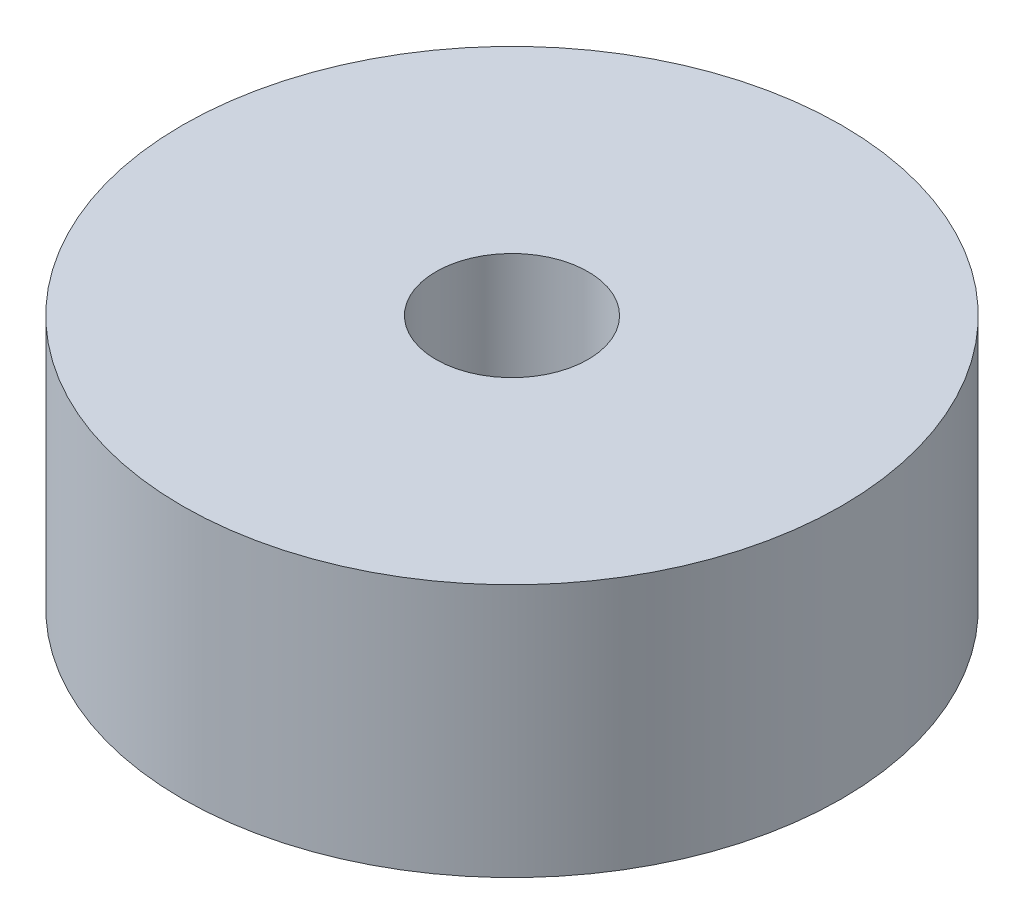
ISO-10303-21;
HEADER;
FILE_DESCRIPTION(('STEP AP214'),'2;1');
FILE_NAME('part.step','',(''),(''),'','','');
FILE_SCHEMA(('AUTOMOTIVE_DESIGN { 1 0 10303 214 1 1 1 1 }'));
ENDSEC;
DATA;
#1=APPLICATION_CONTEXT('core data for automotive mechanical design processes');
#2=APPLICATION_PROTOCOL_DEFINITION('international standard','automotive_design',2000,#1);
#3=PRODUCT_CONTEXT('',#1,'mechanical');
#4=PRODUCT('Part','Part','',(#3));
#5=PRODUCT_RELATED_PRODUCT_CATEGORY('part','',(#4));
#6=PRODUCT_DEFINITION_FORMATION('','',#4);
#7=PRODUCT_DEFINITION_CONTEXT('part definition',#1,'design');
#8=PRODUCT_DEFINITION('design','',#6,#7);
#9=PRODUCT_DEFINITION_SHAPE('','',#8);
#10=(LENGTH_UNIT() NAMED_UNIT(*) SI_UNIT(.MILLI.,.METRE.));
#11=(NAMED_UNIT(*) PLANE_ANGLE_UNIT() SI_UNIT($,.RADIAN.));
#12=(NAMED_UNIT(*) SI_UNIT($,.STERADIAN.) SOLID_ANGLE_UNIT());
#13=UNCERTAINTY_MEASURE_WITH_UNIT(LENGTH_MEASURE(1.E-05),#10,'distance_accuracy_value','');
#14=(GEOMETRIC_REPRESENTATION_CONTEXT(3) GLOBAL_UNCERTAINTY_ASSIGNED_CONTEXT((#13)) GLOBAL_UNIT_ASSIGNED_CONTEXT((#10,
#11,#12)) REPRESENTATION_CONTEXT('',''));
#15=CARTESIAN_POINT('',(0.,0.,0.));
#16=DIRECTION('',(0.,0.,1.));
#17=DIRECTION('',(1.,0.,0.));
#18=AXIS2_PLACEMENT_3D('',#15,#16,#17);
#19=CARTESIAN_POINT('',(0.,5.,0.));
#20=DIRECTION('',(0.,1.,0.));
#21=DIRECTION('',(0.,0.,1.));
#22=AXIS2_PLACEMENT_3D('',#19,#20,#21);
#23=PLANE('',#22);
#24=CARTESIAN_POINT('',(0.,5.,0.));
#25=DIRECTION('',(0.,1.,0.));
#26=DIRECTION('',(0.,0.,1.));
#27=AXIS2_PLACEMENT_3D('',#24,#25,#26);
#28=CIRCLE('',#27,6.5);
#29=CARTESIAN_POINT('',(0.,5.,6.5));
#30=VERTEX_POINT('',#29);
#31=EDGE_CURVE('E10',#30,#30,#28,.T.);
#32=ORIENTED_EDGE('',*,*,#31,.T.);
#33=EDGE_LOOP('',(#32));
#34=FACE_BOUND('',#33,.T.);
#35=CARTESIAN_POINT('',(0.,5.,0.));
#36=DIRECTION('',(0.,1.,0.));
#37=DIRECTION('',(0.,0.,1.));
#38=AXIS2_PLACEMENT_3D('',#35,#36,#37);
#39=CIRCLE('',#38,1.5);
#40=CARTESIAN_POINT('',(0.,5.,1.5));
#41=VERTEX_POINT('',#40);
#42=EDGE_CURVE('E58',#41,#41,#39,.T.);
#43=ORIENTED_EDGE('',*,*,#42,.F.);
#44=EDGE_LOOP('',(#43));
#45=FACE_BOUND('',#44,.T.);
#46=ADVANCED_FACE('F45',(#34,#45),#23,.T.);
#47=CARTESIAN_POINT('',(0.,0.,0.));
#48=DIRECTION('',(0.,1.,0.));
#49=DIRECTION('',(0.,0.,1.));
#50=AXIS2_PLACEMENT_3D('',#47,#48,#49);
#51=PLANE('',#50);
#52=CARTESIAN_POINT('',(0.,0.,0.));
#53=DIRECTION('',(0.,1.,0.));
#54=DIRECTION('',(0.,0.,1.));
#55=AXIS2_PLACEMENT_3D('',#52,#53,#54);
#56=CIRCLE('',#55,6.5);
#57=CARTESIAN_POINT('',(0.,0.,6.5));
#58=VERTEX_POINT('',#57);
#59=EDGE_CURVE('E49',#58,#58,#56,.T.);
#60=ORIENTED_EDGE('',*,*,#59,.F.);
#61=EDGE_LOOP('',(#60));
#62=FACE_BOUND('',#61,.T.);
#63=CARTESIAN_POINT('',(0.,0.,0.));
#64=DIRECTION('',(0.,1.,0.));
#65=DIRECTION('',(0.,0.,1.));
#66=AXIS2_PLACEMENT_3D('',#63,#64,#65);
#67=CIRCLE('',#66,1.5);
#68=CARTESIAN_POINT('',(0.,0.,1.5));
#69=VERTEX_POINT('',#68);
#70=EDGE_CURVE('E60',#69,#69,#67,.T.);
#71=ORIENTED_EDGE('',*,*,#70,.T.);
#72=EDGE_LOOP('',(#71));
#73=FACE_BOUND('',#72,.T.);
#74=ADVANCED_FACE('F72',(#62,#73),#51,.F.);
#75=CARTESIAN_POINT('',(0.,5.,0.));
#76=DIRECTION('',(0.,-1.,0.));
#77=DIRECTION('',(0.,0.,-1.));
#78=AXIS2_PLACEMENT_3D('',#75,#76,#77);
#79=CYLINDRICAL_SURFACE('',#78,6.5);
#80=ORIENTED_EDGE('',*,*,#31,.F.);
#81=EDGE_LOOP('',(#80));
#82=FACE_BOUND('',#81,.T.);
#83=ORIENTED_EDGE('',*,*,#59,.T.);
#84=EDGE_LOOP('',(#83));
#85=FACE_BOUND('',#84,.T.);
#86=ADVANCED_FACE('F47',(#82,#85),#79,.T.);
#87=CARTESIAN_POINT('',(0.,5.,0.));
#88=DIRECTION('',(0.,-1.,0.));
#89=DIRECTION('',(0.,0.,-1.));
#90=AXIS2_PLACEMENT_3D('',#87,#88,#89);
#91=CYLINDRICAL_SURFACE('',#90,1.5);
#92=ORIENTED_EDGE('',*,*,#42,.T.);
#93=EDGE_LOOP('',(#92));
#94=FACE_BOUND('',#93,.T.);
#95=ORIENTED_EDGE('',*,*,#70,.F.);
#96=EDGE_LOOP('',(#95));
#97=FACE_BOUND('',#96,.T.);
#98=ADVANCED_FACE('F68',(#94,#97),#91,.F.);
#99=CLOSED_SHELL('',(#46,#74,#86,#98));
#100=MANIFOLD_SOLID_BREP('B2',#99);
#101=ADVANCED_BREP_SHAPE_REPRESENTATION('',(#18,#100),#14);
#102=SHAPE_DEFINITION_REPRESENTATION(#9,#101);
ENDSEC;
END-ISO-10303-21;
